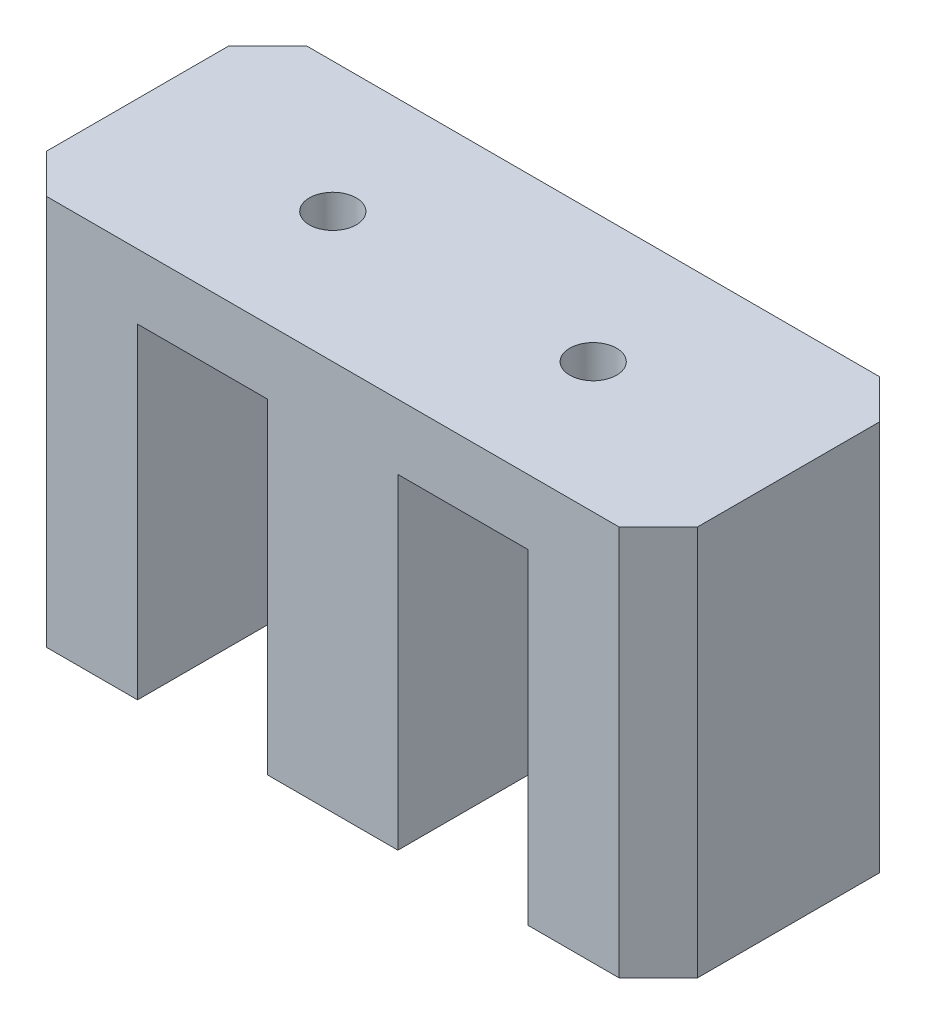
ISO-10303-21;
HEADER;
FILE_DESCRIPTION(('STEP AP214'),'2;1');
FILE_NAME('part.step','',(''),(''),'','','');
FILE_SCHEMA(('AUTOMOTIVE_DESIGN { 1 0 10303 214 1 1 1 1 }'));
ENDSEC;
DATA;
#1=APPLICATION_CONTEXT('core data for automotive mechanical design processes');
#2=APPLICATION_PROTOCOL_DEFINITION('international standard','automotive_design',2000,#1);
#3=PRODUCT_CONTEXT('',#1,'mechanical');
#4=PRODUCT('Part','Part','',(#3));
#5=PRODUCT_RELATED_PRODUCT_CATEGORY('part','',(#4));
#6=PRODUCT_DEFINITION_FORMATION('','',#4);
#7=PRODUCT_DEFINITION_CONTEXT('part definition',#1,'design');
#8=PRODUCT_DEFINITION('design','',#6,#7);
#9=PRODUCT_DEFINITION_SHAPE('','',#8);
#10=(LENGTH_UNIT() NAMED_UNIT(*) SI_UNIT(.MILLI.,.METRE.));
#11=(NAMED_UNIT(*) PLANE_ANGLE_UNIT() SI_UNIT($,.RADIAN.));
#12=(NAMED_UNIT(*) SI_UNIT($,.STERADIAN.) SOLID_ANGLE_UNIT());
#13=UNCERTAINTY_MEASURE_WITH_UNIT(LENGTH_MEASURE(1.E-05),#10,'distance_accuracy_value','');
#14=(GEOMETRIC_REPRESENTATION_CONTEXT(3) GLOBAL_UNCERTAINTY_ASSIGNED_CONTEXT((#13)) GLOBAL_UNIT_ASSIGNED_CONTEXT((#10,
#11,#12)) REPRESENTATION_CONTEXT('',''));
#15=CARTESIAN_POINT('',(0.,0.,0.));
#16=DIRECTION('',(0.,0.,1.));
#17=DIRECTION('',(1.,0.,0.));
#18=AXIS2_PLACEMENT_3D('',#15,#16,#17);
#19=CARTESIAN_POINT('',(0.,0.,0.));
#20=DIRECTION('',(0.,1.,0.));
#21=DIRECTION('',(0.,0.,1.));
#22=AXIS2_PLACEMENT_3D('',#19,#20,#21);
#23=PLANE('',#22);
#24=DIRECTION('',(0.,0.,1.));
#25=VECTOR('',#24,1.);
#26=CARTESIAN_POINT('',(-25.,0.,-10.));
#27=LINE('',#26,#25);
#28=CARTESIAN_POINT('',(-25.,0.,-7.));
#29=VERTEX_POINT('',#28);
#30=CARTESIAN_POINT('',(-25.,0.,7.));
#31=VERTEX_POINT('',#30);
#32=EDGE_CURVE('E201',#29,#31,#27,.T.);
#33=ORIENTED_EDGE('',*,*,#32,.F.);
#34=DIRECTION('',(-0.707106781186548,0.,0.707106781186547));
#35=VECTOR('',#34,1.);
#36=CARTESIAN_POINT('',(-25.,0.,-7.));
#37=LINE('',#36,#35);
#38=CARTESIAN_POINT('',(-22.,0.,-10.));
#39=VERTEX_POINT('',#38);
#40=EDGE_CURVE('E291',#29,#39,#37,.F.);
#41=ORIENTED_EDGE('',*,*,#40,.T.);
#42=DIRECTION('',(-1.,0.,0.));
#43=VECTOR('',#42,1.);
#44=CARTESIAN_POINT('',(-25.,0.,-10.));
#45=LINE('',#44,#43);
#46=CARTESIAN_POINT('',(-15.,0.,-10.));
#47=VERTEX_POINT('',#46);
#48=EDGE_CURVE('E274',#47,#39,#45,.T.);
#49=ORIENTED_EDGE('',*,*,#48,.F.);
#50=DIRECTION('',(0.,0.,-1.));
#51=VECTOR('',#50,1.);
#52=CARTESIAN_POINT('',(-15.,0.,10.));
#53=LINE('',#52,#51);
#54=CARTESIAN_POINT('',(-15.,0.,10.));
#55=VERTEX_POINT('',#54);
#56=EDGE_CURVE('E162',#55,#47,#53,.T.);
#57=ORIENTED_EDGE('',*,*,#56,.F.);
#58=DIRECTION('',(1.,0.,0.));
#59=VECTOR('',#58,1.);
#60=CARTESIAN_POINT('',(-25.,0.,10.));
#61=LINE('',#60,#59);
#62=CARTESIAN_POINT('',(-22.,0.,10.));
#63=VERTEX_POINT('',#62);
#64=EDGE_CURVE('E267',#63,#55,#61,.T.);
#65=ORIENTED_EDGE('',*,*,#64,.F.);
#66=DIRECTION('',(0.707106781186547,0.,0.707106781186548));
#67=VECTOR('',#66,1.);
#68=CARTESIAN_POINT('',(-22.,0.,10.));
#69=LINE('',#68,#67);
#70=EDGE_CURVE('E288',#63,#31,#69,.F.);
#71=ORIENTED_EDGE('',*,*,#70,.T.);
#72=EDGE_LOOP('',(#33,#41,#49,#57,#65,#71));
#73=FACE_BOUND('',#72,.T.);
#74=ADVANCED_FACE('F40',(#73),#23,.F.);
#75=CARTESIAN_POINT('',(-5.,0.,10.));
#76=VERTEX_POINT('',#75);
#77=CARTESIAN_POINT('',(5.,0.,10.));
#78=VERTEX_POINT('',#77);
#79=EDGE_CURVE('E271',#76,#78,#61,.T.);
#80=ORIENTED_EDGE('',*,*,#79,.F.);
#81=DIRECTION('',(0.,0.,1.));
#82=VECTOR('',#81,1.);
#83=CARTESIAN_POINT('',(-5.,0.,10.));
#84=LINE('',#83,#82);
#85=CARTESIAN_POINT('',(-5.,0.,-10.));
#86=VERTEX_POINT('',#85);
#87=EDGE_CURVE('E180',#86,#76,#84,.T.);
#88=ORIENTED_EDGE('',*,*,#87,.F.);
#89=CARTESIAN_POINT('',(5.,0.,-10.));
#90=VERTEX_POINT('',#89);
#91=EDGE_CURVE('E277',#90,#86,#45,.T.);
#92=ORIENTED_EDGE('',*,*,#91,.F.);
#93=DIRECTION('',(0.,0.,-1.));
#94=VECTOR('',#93,1.);
#95=CARTESIAN_POINT('',(5.,0.,10.));
#96=LINE('',#95,#94);
#97=EDGE_CURVE('E226',#78,#90,#96,.T.);
#98=ORIENTED_EDGE('',*,*,#97,.F.);
#99=EDGE_LOOP('',(#80,#88,#92,#98));
#100=FACE_BOUND('',#99,.T.);
#101=ADVANCED_FACE('F343',(#100),#23,.F.);
#102=CARTESIAN_POINT('',(-25.,30.,-10.));
#103=DIRECTION('',(1.,0.,0.));
#104=DIRECTION('',(0.,0.,-1.));
#105=AXIS2_PLACEMENT_3D('',#102,#103,#104);
#106=PLANE('',#105);
#107=DIRECTION('',(0.,0.,1.));
#108=VECTOR('',#107,1.);
#109=CARTESIAN_POINT('',(-25.,30.,-10.));
#110=LINE('',#109,#108);
#111=CARTESIAN_POINT('',(-25.,30.,-7.));
#112=VERTEX_POINT('',#111);
#113=CARTESIAN_POINT('',(-25.,30.,7.));
#114=VERTEX_POINT('',#113);
#115=EDGE_CURVE('E245',#112,#114,#110,.T.);
#116=ORIENTED_EDGE('',*,*,#115,.F.);
#117=DIRECTION('',(0.,-1.,0.));
#118=VECTOR('',#117,1.);
#119=CARTESIAN_POINT('',(-25.,30.,-7.));
#120=LINE('',#119,#118);
#121=EDGE_CURVE('E284',#112,#29,#120,.T.);
#122=ORIENTED_EDGE('',*,*,#121,.T.);
#123=ORIENTED_EDGE('',*,*,#32,.T.);
#124=DIRECTION('',(0.,1.,0.));
#125=VECTOR('',#124,1.);
#126=CARTESIAN_POINT('',(-25.,30.,7.00000000000001));
#127=LINE('',#126,#125);
#128=EDGE_CURVE('E262',#31,#114,#127,.T.);
#129=ORIENTED_EDGE('',*,*,#128,.T.);
#130=EDGE_LOOP('',(#116,#122,#123,#129));
#131=FACE_BOUND('',#130,.T.);
#132=ADVANCED_FACE('F372',(#131),#106,.F.);
#133=CARTESIAN_POINT('',(-25.,30.,10.));
#134=DIRECTION('',(0.,0.,-1.));
#135=DIRECTION('',(-1.,0.,0.));
#136=AXIS2_PLACEMENT_3D('',#133,#134,#135);
#137=PLANE('',#136);
#138=CARTESIAN_POINT('',(15.,0.,10.));
#139=VERTEX_POINT('',#138);
#140=CARTESIAN_POINT('',(22.,0.,10.));
#141=VERTEX_POINT('',#140);
#142=EDGE_CURVE('E266',#139,#141,#61,.T.);
#143=ORIENTED_EDGE('',*,*,#142,.T.);
#144=DIRECTION('',(0.,1.,0.));
#145=VECTOR('',#144,1.);
#146=CARTESIAN_POINT('',(22.,30.,10.));
#147=LINE('',#146,#145);
#148=CARTESIAN_POINT('',(22.,30.,10.));
#149=VERTEX_POINT('',#148);
#150=EDGE_CURVE('E11',#141,#149,#147,.T.);
#151=ORIENTED_EDGE('',*,*,#150,.T.);
#152=DIRECTION('',(1.,0.,0.));
#153=VECTOR('',#152,1.);
#154=CARTESIAN_POINT('',(-25.,30.,10.));
#155=LINE('',#154,#153);
#156=CARTESIAN_POINT('',(-22.,30.,10.));
#157=VERTEX_POINT('',#156);
#158=EDGE_CURVE('E249',#157,#149,#155,.T.);
#159=ORIENTED_EDGE('',*,*,#158,.F.);
#160=DIRECTION('',(0.,-1.,0.));
#161=VECTOR('',#160,1.);
#162=CARTESIAN_POINT('',(-22.,30.,10.));
#163=LINE('',#162,#161);
#164=EDGE_CURVE('E50',#157,#63,#163,.T.);
#165=ORIENTED_EDGE('',*,*,#164,.T.);
#166=ORIENTED_EDGE('',*,*,#64,.T.);
#167=DIRECTION('',(0.,-1.,0.));
#168=VECTOR('',#167,1.);
#169=CARTESIAN_POINT('',(-15.,25.,10.));
#170=LINE('',#169,#168);
#171=CARTESIAN_POINT('',(-15.,25.,10.));
#172=VERTEX_POINT('',#171);
#173=EDGE_CURVE('E198',#172,#55,#170,.T.);
#174=ORIENTED_EDGE('',*,*,#173,.F.);
#175=DIRECTION('',(-1.,0.,0.));
#176=VECTOR('',#175,1.);
#177=CARTESIAN_POINT('',(-15.,25.,10.));
#178=LINE('',#177,#176);
#179=CARTESIAN_POINT('',(-5.,25.,10.));
#180=VERTEX_POINT('',#179);
#181=EDGE_CURVE('E169',#180,#172,#178,.T.);
#182=ORIENTED_EDGE('',*,*,#181,.F.);
#183=DIRECTION('',(0.,-1.,0.));
#184=VECTOR('',#183,1.);
#185=CARTESIAN_POINT('',(-5.,25.,10.));
#186=LINE('',#185,#184);
#187=EDGE_CURVE('E202',#180,#76,#186,.T.);
#188=ORIENTED_EDGE('',*,*,#187,.T.);
#189=ORIENTED_EDGE('',*,*,#79,.T.);
#190=DIRECTION('',(0.,-1.,0.));
#191=VECTOR('',#190,1.);
#192=CARTESIAN_POINT('',(5.,25.,10.));
#193=LINE('',#192,#191);
#194=CARTESIAN_POINT('',(5.,25.,10.));
#195=VERTEX_POINT('',#194);
#196=EDGE_CURVE('E195',#195,#78,#193,.T.);
#197=ORIENTED_EDGE('',*,*,#196,.F.);
#198=DIRECTION('',(-1.,0.,0.));
#199=VECTOR('',#198,1.);
#200=CARTESIAN_POINT('',(5.,25.,10.));
#201=LINE('',#200,#199);
#202=CARTESIAN_POINT('',(15.,25.,10.));
#203=VERTEX_POINT('',#202);
#204=EDGE_CURVE('E221',#203,#195,#201,.T.);
#205=ORIENTED_EDGE('',*,*,#204,.F.);
#206=DIRECTION('',(0.,-1.,0.));
#207=VECTOR('',#206,1.);
#208=CARTESIAN_POINT('',(15.,25.,10.));
#209=LINE('',#208,#207);
#210=EDGE_CURVE('E234',#203,#139,#209,.T.);
#211=ORIENTED_EDGE('',*,*,#210,.T.);
#212=EDGE_LOOP('',(#143,#151,#159,#165,#166,#174,#182,#188,#189,#197,#205,#211));
#213=FACE_BOUND('',#212,.T.);
#214=ADVANCED_FACE('F329',(#213),#137,.F.);
#215=CARTESIAN_POINT('',(25.,30.,-10.));
#216=DIRECTION('',(-1.,0.,0.));
#217=DIRECTION('',(0.,0.,1.));
#218=AXIS2_PLACEMENT_3D('',#215,#216,#217);
#219=PLANE('',#218);
#220=DIRECTION('',(0.,0.,-1.));
#221=VECTOR('',#220,1.);
#222=CARTESIAN_POINT('',(25.,0.,-10.));
#223=LINE('',#222,#221);
#224=CARTESIAN_POINT('',(25.,0.,6.99999999999999));
#225=VERTEX_POINT('',#224);
#226=CARTESIAN_POINT('',(25.,0.,-7.));
#227=VERTEX_POINT('',#226);
#228=EDGE_CURVE('E270',#225,#227,#223,.T.);
#229=ORIENTED_EDGE('',*,*,#228,.T.);
#230=DIRECTION('',(0.,1.,0.));
#231=VECTOR('',#230,1.);
#232=CARTESIAN_POINT('',(25.,30.,-7.));
#233=LINE('',#232,#231);
#234=CARTESIAN_POINT('',(25.,30.,-7.));
#235=VERTEX_POINT('',#234);
#236=EDGE_CURVE('E320',#227,#235,#233,.T.);
#237=ORIENTED_EDGE('',*,*,#236,.T.);
#238=DIRECTION('',(0.,0.,-1.));
#239=VECTOR('',#238,1.);
#240=CARTESIAN_POINT('',(25.,30.,-10.));
#241=LINE('',#240,#239);
#242=CARTESIAN_POINT('',(25.,30.,6.99999999999999));
#243=VERTEX_POINT('',#242);
#244=EDGE_CURVE('E254',#243,#235,#241,.T.);
#245=ORIENTED_EDGE('',*,*,#244,.F.);
#246=DIRECTION('',(0.,-1.,0.));
#247=VECTOR('',#246,1.);
#248=CARTESIAN_POINT('',(25.,30.,6.99999999999999));
#249=LINE('',#248,#247);
#250=EDGE_CURVE('E317',#243,#225,#249,.T.);
#251=ORIENTED_EDGE('',*,*,#250,.T.);
#252=EDGE_LOOP('',(#229,#237,#245,#251));
#253=FACE_BOUND('',#252,.T.);
#254=ADVANCED_FACE('F360',(#253),#219,.F.);
#255=CARTESIAN_POINT('',(-25.,30.,-10.));
#256=DIRECTION('',(0.,0.,1.));
#257=DIRECTION('',(1.,0.,0.));
#258=AXIS2_PLACEMENT_3D('',#255,#256,#257);
#259=PLANE('',#258);
#260=ORIENTED_EDGE('',*,*,#48,.T.);
#261=DIRECTION('',(0.,1.,0.));
#262=VECTOR('',#261,1.);
#263=CARTESIAN_POINT('',(-22.,30.,-10.));
#264=LINE('',#263,#262);
#265=CARTESIAN_POINT('',(-22.,30.,-10.));
#266=VERTEX_POINT('',#265);
#267=EDGE_CURVE('E298',#39,#266,#264,.T.);
#268=ORIENTED_EDGE('',*,*,#267,.T.);
#269=DIRECTION('',(-1.,0.,0.));
#270=VECTOR('',#269,1.);
#271=CARTESIAN_POINT('',(-25.,30.,-10.));
#272=LINE('',#271,#270);
#273=CARTESIAN_POINT('',(22.,30.,-10.));
#274=VERTEX_POINT('',#273);
#275=EDGE_CURVE('E258',#274,#266,#272,.T.);
#276=ORIENTED_EDGE('',*,*,#275,.F.);
#277=DIRECTION('',(0.,-1.,0.));
#278=VECTOR('',#277,1.);
#279=CARTESIAN_POINT('',(22.,30.,-10.));
#280=LINE('',#279,#278);
#281=CARTESIAN_POINT('',(22.,0.,-10.));
#282=VERTEX_POINT('',#281);
#283=EDGE_CURVE('E294',#274,#282,#280,.T.);
#284=ORIENTED_EDGE('',*,*,#283,.T.);
#285=CARTESIAN_POINT('',(15.,0.,-10.));
#286=VERTEX_POINT('',#285);
#287=EDGE_CURVE('E250',#282,#286,#45,.T.);
#288=ORIENTED_EDGE('',*,*,#287,.T.);
#289=DIRECTION('',(0.,-1.,0.));
#290=VECTOR('',#289,1.);
#291=CARTESIAN_POINT('',(15.,25.,-10.));
#292=LINE('',#291,#290);
#293=CARTESIAN_POINT('',(15.,25.,-10.));
#294=VERTEX_POINT('',#293);
#295=EDGE_CURVE('E238',#294,#286,#292,.T.);
#296=ORIENTED_EDGE('',*,*,#295,.F.);
#297=DIRECTION('',(1.,0.,0.));
#298=VECTOR('',#297,1.);
#299=CARTESIAN_POINT('',(5.,25.,-10.));
#300=LINE('',#299,#298);
#301=CARTESIAN_POINT('',(5.,25.,-10.));
#302=VERTEX_POINT('',#301);
#303=EDGE_CURVE('E212',#302,#294,#300,.T.);
#304=ORIENTED_EDGE('',*,*,#303,.F.);
#305=DIRECTION('',(0.,-1.,0.));
#306=VECTOR('',#305,1.);
#307=CARTESIAN_POINT('',(5.,25.,-10.));
#308=LINE('',#307,#306);
#309=EDGE_CURVE('E225',#302,#90,#308,.T.);
#310=ORIENTED_EDGE('',*,*,#309,.T.);
#311=ORIENTED_EDGE('',*,*,#91,.T.);
#312=DIRECTION('',(0.,-1.,0.));
#313=VECTOR('',#312,1.);
#314=CARTESIAN_POINT('',(-5.,25.,-10.));
#315=LINE('',#314,#313);
#316=CARTESIAN_POINT('',(-5.,25.,-10.));
#317=VERTEX_POINT('',#316);
#318=EDGE_CURVE('E168',#317,#86,#315,.T.);
#319=ORIENTED_EDGE('',*,*,#318,.F.);
#320=DIRECTION('',(1.,0.,0.));
#321=VECTOR('',#320,1.);
#322=CARTESIAN_POINT('',(-15.,25.,-10.));
#323=LINE('',#322,#321);
#324=CARTESIAN_POINT('',(-15.,25.,-10.));
#325=VERTEX_POINT('',#324);
#326=EDGE_CURVE('E175',#325,#317,#323,.T.);
#327=ORIENTED_EDGE('',*,*,#326,.F.);
#328=DIRECTION('',(0.,-1.,0.));
#329=VECTOR('',#328,1.);
#330=CARTESIAN_POINT('',(-15.,25.,-10.));
#331=LINE('',#330,#329);
#332=EDGE_CURVE('E155',#325,#47,#331,.T.);
#333=ORIENTED_EDGE('',*,*,#332,.T.);
#334=EDGE_LOOP('',(#260,#268,#276,#284,#288,#296,#304,#310,#311,#319,#327,#333));
#335=FACE_BOUND('',#334,.T.);
#336=ADVANCED_FACE('F182',(#335),#259,.F.);
#337=CARTESIAN_POINT('',(0.,30.,0.));
#338=DIRECTION('',(0.,1.,0.));
#339=DIRECTION('',(0.,0.,1.));
#340=AXIS2_PLACEMENT_3D('',#337,#338,#339);
#341=PLANE('',#340);
#342=CARTESIAN_POINT('',(-10.,30.,0.));
#343=DIRECTION('',(0.,1.,0.));
#344=DIRECTION('',(0.,0.,1.));
#345=AXIS2_PLACEMENT_3D('',#342,#343,#344);
#346=CIRCLE('',#345,1.79999999999999);
#347=CARTESIAN_POINT('',(-10.,30.,1.79999999999999));
#348=VERTEX_POINT('',#347);
#349=EDGE_CURVE('E435',#348,#348,#346,.T.);
#350=ORIENTED_EDGE('',*,*,#349,.F.);
#351=EDGE_LOOP('',(#350));
#352=FACE_BOUND('',#351,.T.);
#353=CARTESIAN_POINT('',(10.,30.,0.));
#354=DIRECTION('',(0.,1.,0.));
#355=DIRECTION('',(0.,0.,1.));
#356=AXIS2_PLACEMENT_3D('',#353,#354,#355);
#357=CIRCLE('',#356,1.79999999999999);
#358=CARTESIAN_POINT('',(10.,30.,1.79999999999999));
#359=VERTEX_POINT('',#358);
#360=EDGE_CURVE('E281',#359,#359,#357,.T.);
#361=ORIENTED_EDGE('',*,*,#360,.F.);
#362=EDGE_LOOP('',(#361));
#363=FACE_BOUND('',#362,.T.);
#364=ORIENTED_EDGE('',*,*,#275,.T.);
#365=DIRECTION('',(0.707106781186548,0.,-0.707106781186547));
#366=VECTOR('',#365,1.);
#367=CARTESIAN_POINT('',(-16.,30.,-16.));
#368=LINE('',#367,#366);
#369=EDGE_CURVE('E310',#266,#112,#368,.F.);
#370=ORIENTED_EDGE('',*,*,#369,.T.);
#371=ORIENTED_EDGE('',*,*,#115,.T.);
#372=DIRECTION('',(-0.707106781186547,0.,-0.707106781186548));
#373=VECTOR('',#372,1.);
#374=CARTESIAN_POINT('',(-16.,30.,16.));
#375=LINE('',#374,#373);
#376=EDGE_CURVE('E301',#114,#157,#375,.F.);
#377=ORIENTED_EDGE('',*,*,#376,.T.);
#378=ORIENTED_EDGE('',*,*,#158,.T.);
#379=DIRECTION('',(-0.707106781186548,0.,0.707106781186547));
#380=VECTOR('',#379,1.);
#381=CARTESIAN_POINT('',(16.,30.,16.));
#382=LINE('',#381,#380);
#383=EDGE_CURVE('E304',#149,#243,#382,.F.);
#384=ORIENTED_EDGE('',*,*,#383,.T.);
#385=ORIENTED_EDGE('',*,*,#244,.T.);
#386=DIRECTION('',(0.707106781186547,0.,0.707106781186548));
#387=VECTOR('',#386,1.);
#388=CARTESIAN_POINT('',(16.,30.,-16.));
#389=LINE('',#388,#387);
#390=EDGE_CURVE('E307',#235,#274,#389,.F.);
#391=ORIENTED_EDGE('',*,*,#390,.T.);
#392=EDGE_LOOP('',(#364,#370,#371,#377,#378,#384,#385,#391));
#393=FACE_BOUND('',#392,.T.);
#394=ADVANCED_FACE('F357',(#352,#363,#393),#341,.T.);
#395=ORIENTED_EDGE('',*,*,#287,.F.);
#396=DIRECTION('',(-0.707106781186547,0.,-0.707106781186548));
#397=VECTOR('',#396,1.);
#398=CARTESIAN_POINT('',(22.,0.,-10.));
#399=LINE('',#398,#397);
#400=EDGE_CURVE('E57',#282,#227,#399,.F.);
#401=ORIENTED_EDGE('',*,*,#400,.T.);
#402=ORIENTED_EDGE('',*,*,#228,.F.);
#403=DIRECTION('',(0.707106781186548,0.,-0.707106781186547));
#404=VECTOR('',#403,1.);
#405=CARTESIAN_POINT('',(25.,0.,6.99999999999999));
#406=LINE('',#405,#404);
#407=EDGE_CURVE('E65',#225,#141,#406,.F.);
#408=ORIENTED_EDGE('',*,*,#407,.T.);
#409=ORIENTED_EDGE('',*,*,#142,.F.);
#410=DIRECTION('',(0.,0.,1.));
#411=VECTOR('',#410,1.);
#412=CARTESIAN_POINT('',(15.,0.,10.));
#413=LINE('',#412,#411);
#414=EDGE_CURVE('E213',#286,#139,#413,.T.);
#415=ORIENTED_EDGE('',*,*,#414,.F.);
#416=EDGE_LOOP('',(#395,#401,#402,#408,#409,#415));
#417=FACE_BOUND('',#416,.T.);
#418=ADVANCED_FACE('F380',(#417),#23,.F.);
#419=CARTESIAN_POINT('',(5.,25.,10.));
#420=DIRECTION('',(-1.,0.,0.));
#421=DIRECTION('',(0.,0.,1.));
#422=AXIS2_PLACEMENT_3D('',#419,#420,#421);
#423=PLANE('',#422);
#424=ORIENTED_EDGE('',*,*,#97,.T.);
#425=ORIENTED_EDGE('',*,*,#309,.F.);
#426=DIRECTION('',(0.,0.,-1.));
#427=VECTOR('',#426,1.);
#428=CARTESIAN_POINT('',(5.,25.,10.));
#429=LINE('',#428,#427);
#430=EDGE_CURVE('E208',#195,#302,#429,.T.);
#431=ORIENTED_EDGE('',*,*,#430,.F.);
#432=ORIENTED_EDGE('',*,*,#196,.T.);
#433=EDGE_LOOP('',(#424,#425,#431,#432));
#434=FACE_BOUND('',#433,.T.);
#435=ADVANCED_FACE('F389',(#434),#423,.F.);
#436=CARTESIAN_POINT('',(15.,25.,10.));
#437=DIRECTION('',(1.,0.,0.));
#438=DIRECTION('',(0.,0.,-1.));
#439=AXIS2_PLACEMENT_3D('',#436,#437,#438);
#440=PLANE('',#439);
#441=ORIENTED_EDGE('',*,*,#414,.T.);
#442=ORIENTED_EDGE('',*,*,#210,.F.);
#443=DIRECTION('',(0.,0.,1.));
#444=VECTOR('',#443,1.);
#445=CARTESIAN_POINT('',(15.,25.,10.));
#446=LINE('',#445,#444);
#447=EDGE_CURVE('E217',#294,#203,#446,.T.);
#448=ORIENTED_EDGE('',*,*,#447,.F.);
#449=ORIENTED_EDGE('',*,*,#295,.T.);
#450=EDGE_LOOP('',(#441,#442,#448,#449));
#451=FACE_BOUND('',#450,.T.);
#452=ADVANCED_FACE('F395',(#451),#440,.F.);
#453=CARTESIAN_POINT('',(0.,25.,0.));
#454=DIRECTION('',(0.,-1.,0.));
#455=DIRECTION('',(0.,0.,-1.));
#456=AXIS2_PLACEMENT_3D('',#453,#454,#455);
#457=PLANE('',#456);
#458=CARTESIAN_POINT('',(10.,25.,0.));
#459=DIRECTION('',(0.,-1.,0.));
#460=DIRECTION('',(0.,0.,-1.));
#461=AXIS2_PLACEMENT_3D('',#458,#459,#460);
#462=CIRCLE('',#461,1.79999999999999);
#463=CARTESIAN_POINT('',(10.,25.,-1.79999999999999));
#464=VERTEX_POINT('',#463);
#465=EDGE_CURVE('E229',#464,#464,#462,.T.);
#466=ORIENTED_EDGE('',*,*,#465,.F.);
#467=EDGE_LOOP('',(#466));
#468=FACE_BOUND('',#467,.T.);
#469=ORIENTED_EDGE('',*,*,#430,.T.);
#470=ORIENTED_EDGE('',*,*,#303,.T.);
#471=ORIENTED_EDGE('',*,*,#447,.T.);
#472=ORIENTED_EDGE('',*,*,#204,.T.);
#473=EDGE_LOOP('',(#469,#470,#471,#472));
#474=FACE_BOUND('',#473,.T.);
#475=ADVANCED_FACE('F402',(#468,#474),#457,.T.);
#476=CARTESIAN_POINT('',(-15.,25.,10.));
#477=DIRECTION('',(-1.,0.,0.));
#478=DIRECTION('',(0.,0.,1.));
#479=AXIS2_PLACEMENT_3D('',#476,#477,#478);
#480=PLANE('',#479);
#481=ORIENTED_EDGE('',*,*,#56,.T.);
#482=ORIENTED_EDGE('',*,*,#332,.F.);
#483=DIRECTION('',(0.,0.,-1.));
#484=VECTOR('',#483,1.);
#485=CARTESIAN_POINT('',(-15.,25.,10.));
#486=LINE('',#485,#484);
#487=EDGE_CURVE('E159',#172,#325,#486,.T.);
#488=ORIENTED_EDGE('',*,*,#487,.F.);
#489=ORIENTED_EDGE('',*,*,#173,.T.);
#490=EDGE_LOOP('',(#481,#482,#488,#489));
#491=FACE_BOUND('',#490,.T.);
#492=ADVANCED_FACE('F157',(#491),#480,.F.);
#493=CARTESIAN_POINT('',(-5.,25.,10.));
#494=DIRECTION('',(1.,0.,0.));
#495=DIRECTION('',(0.,0.,-1.));
#496=AXIS2_PLACEMENT_3D('',#493,#494,#495);
#497=PLANE('',#496);
#498=ORIENTED_EDGE('',*,*,#87,.T.);
#499=ORIENTED_EDGE('',*,*,#187,.F.);
#500=DIRECTION('',(0.,0.,1.));
#501=VECTOR('',#500,1.);
#502=CARTESIAN_POINT('',(-5.,25.,10.));
#503=LINE('',#502,#501);
#504=EDGE_CURVE('E185',#317,#180,#503,.T.);
#505=ORIENTED_EDGE('',*,*,#504,.F.);
#506=ORIENTED_EDGE('',*,*,#318,.T.);
#507=EDGE_LOOP('',(#498,#499,#505,#506));
#508=FACE_BOUND('',#507,.T.);
#509=ADVANCED_FACE('F346',(#508),#497,.F.);
#510=CARTESIAN_POINT('',(0.,25.,0.));
#511=DIRECTION('',(0.,-1.,0.));
#512=DIRECTION('',(0.,0.,-1.));
#513=AXIS2_PLACEMENT_3D('',#510,#511,#512);
#514=PLANE('',#513);
#515=CARTESIAN_POINT('',(-10.,25.,0.));
#516=DIRECTION('',(0.,-1.,0.));
#517=DIRECTION('',(0.,0.,-1.));
#518=AXIS2_PLACEMENT_3D('',#515,#516,#517);
#519=CIRCLE('',#518,1.79999999999999);
#520=CARTESIAN_POINT('',(-10.,25.,-1.79999999999999));
#521=VERTEX_POINT('',#520);
#522=EDGE_CURVE('E432',#521,#521,#519,.T.);
#523=ORIENTED_EDGE('',*,*,#522,.F.);
#524=EDGE_LOOP('',(#523));
#525=FACE_BOUND('',#524,.T.);
#526=ORIENTED_EDGE('',*,*,#487,.T.);
#527=ORIENTED_EDGE('',*,*,#326,.T.);
#528=ORIENTED_EDGE('',*,*,#504,.T.);
#529=ORIENTED_EDGE('',*,*,#181,.T.);
#530=EDGE_LOOP('',(#526,#527,#528,#529));
#531=FACE_BOUND('',#530,.T.);
#532=ADVANCED_FACE('F173',(#525,#531),#514,.T.);
#533=CARTESIAN_POINT('',(10.,30.,0.));
#534=DIRECTION('',(0.,1.,0.));
#535=DIRECTION('',(0.,0.,1.));
#536=AXIS2_PLACEMENT_3D('',#533,#534,#535);
#537=CYLINDRICAL_SURFACE('',#536,1.79999999999999);
#538=ORIENTED_EDGE('',*,*,#465,.T.);
#539=EDGE_LOOP('',(#538));
#540=FACE_BOUND('',#539,.T.);
#541=ORIENTED_EDGE('',*,*,#360,.T.);
#542=EDGE_LOOP('',(#541));
#543=FACE_BOUND('',#542,.T.);
#544=ADVANCED_FACE('F418',(#540,#543),#537,.F.);
#545=CARTESIAN_POINT('',(-10.,30.,0.));
#546=DIRECTION('',(0.,1.,0.));
#547=DIRECTION('',(0.,0.,1.));
#548=AXIS2_PLACEMENT_3D('',#545,#546,#547);
#549=CYLINDRICAL_SURFACE('',#548,1.79999999999999);
#550=ORIENTED_EDGE('',*,*,#522,.T.);
#551=EDGE_LOOP('',(#550));
#552=FACE_BOUND('',#551,.T.);
#553=ORIENTED_EDGE('',*,*,#349,.T.);
#554=EDGE_LOOP('',(#553));
#555=FACE_BOUND('',#554,.T.);
#556=ADVANCED_FACE('F422',(#552,#555),#549,.F.);
#557=CARTESIAN_POINT('',(-25.,30.,-7.));
#558=DIRECTION('',(0.707106781186547,0.,0.707106781186548));
#559=DIRECTION('',(0.,-1.,0.));
#560=AXIS2_PLACEMENT_3D('',#557,#558,#559);
#561=PLANE('',#560);
#562=ORIENTED_EDGE('',*,*,#369,.F.);
#563=ORIENTED_EDGE('',*,*,#267,.F.);
#564=ORIENTED_EDGE('',*,*,#40,.F.);
#565=ORIENTED_EDGE('',*,*,#121,.F.);
#566=EDGE_LOOP('',(#562,#563,#564,#565));
#567=FACE_BOUND('',#566,.T.);
#568=ADVANCED_FACE('F368',(#567),#561,.F.);
#569=CARTESIAN_POINT('',(22.,30.,-10.));
#570=DIRECTION('',(-0.707106781186548,0.,0.707106781186547));
#571=DIRECTION('',(0.,-1.,0.));
#572=AXIS2_PLACEMENT_3D('',#569,#570,#571);
#573=PLANE('',#572);
#574=ORIENTED_EDGE('',*,*,#390,.F.);
#575=ORIENTED_EDGE('',*,*,#236,.F.);
#576=ORIENTED_EDGE('',*,*,#400,.F.);
#577=ORIENTED_EDGE('',*,*,#283,.F.);
#578=EDGE_LOOP('',(#574,#575,#576,#577));
#579=FACE_BOUND('',#578,.T.);
#580=ADVANCED_FACE('F363',(#579),#573,.F.);
#581=CARTESIAN_POINT('',(25.,30.,6.99999999999999));
#582=DIRECTION('',(-0.707106781186547,0.,-0.707106781186548));
#583=DIRECTION('',(0.,-1.,0.));
#584=AXIS2_PLACEMENT_3D('',#581,#582,#583);
#585=PLANE('',#584);
#586=ORIENTED_EDGE('',*,*,#383,.F.);
#587=ORIENTED_EDGE('',*,*,#150,.F.);
#588=ORIENTED_EDGE('',*,*,#407,.F.);
#589=ORIENTED_EDGE('',*,*,#250,.F.);
#590=EDGE_LOOP('',(#586,#587,#588,#589));
#591=FACE_BOUND('',#590,.T.);
#592=ADVANCED_FACE('F354',(#591),#585,.F.);
#593=CARTESIAN_POINT('',(-22.,30.,10.));
#594=DIRECTION('',(0.707106781186548,0.,-0.707106781186547));
#595=DIRECTION('',(0.,-1.,0.));
#596=AXIS2_PLACEMENT_3D('',#593,#594,#595);
#597=PLANE('',#596);
#598=ORIENTED_EDGE('',*,*,#376,.F.);
#599=ORIENTED_EDGE('',*,*,#128,.F.);
#600=ORIENTED_EDGE('',*,*,#70,.F.);
#601=ORIENTED_EDGE('',*,*,#164,.F.);
#602=EDGE_LOOP('',(#598,#599,#600,#601));
#603=FACE_BOUND('',#602,.T.);
#604=ADVANCED_FACE('F43',(#603),#597,.F.);
#605=CLOSED_SHELL('',(#74,#101,#132,#214,#254,#336,#394,#418,#435,#452,#475,#492,#509,#532,#544,
#556,#568,#580,#592,#604));
#606=MANIFOLD_SOLID_BREP('B2',#605);
#607=ADVANCED_BREP_SHAPE_REPRESENTATION('',(#18,#606),#14);
#608=SHAPE_DEFINITION_REPRESENTATION(#9,#607);
ENDSEC;
END-ISO-10303-21;
